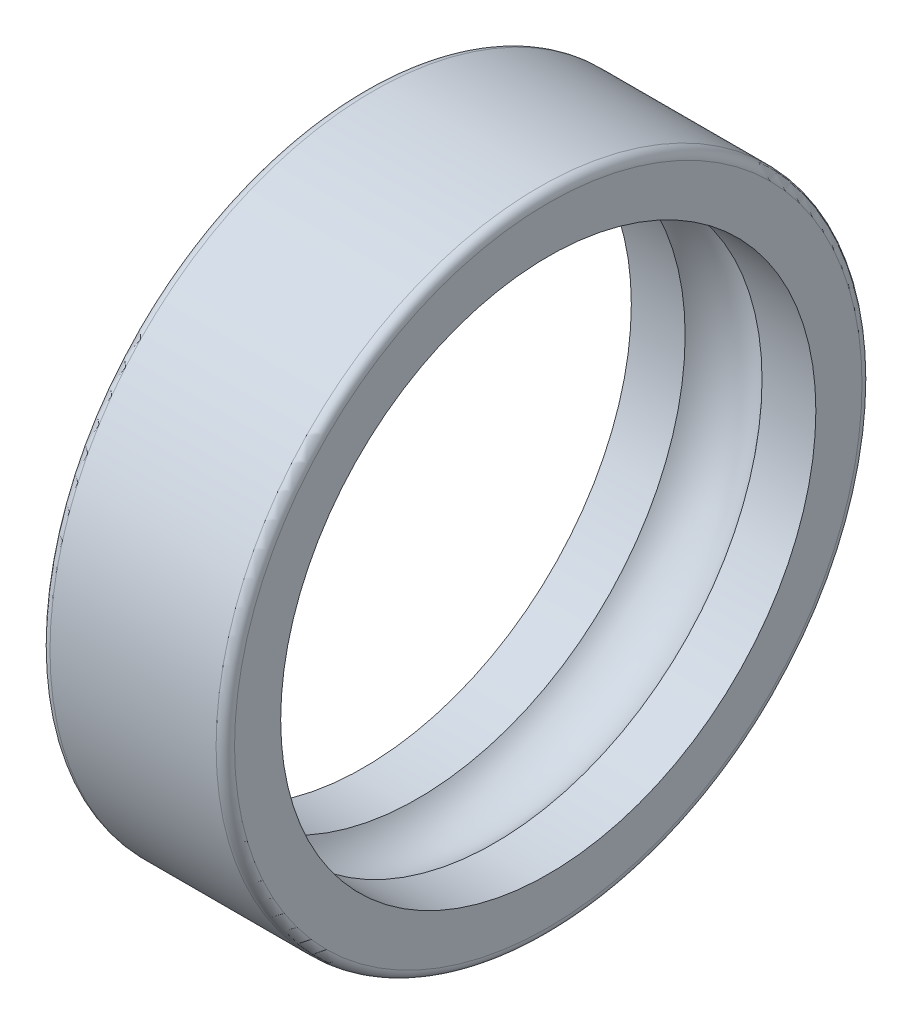
ISO-10303-21;
HEADER;
FILE_DESCRIPTION(('STEP AP214'),'2;1');
FILE_NAME('part.step','',(''),(''),'','','');
FILE_SCHEMA(('AUTOMOTIVE_DESIGN { 1 0 10303 214 1 1 1 1 }'));
ENDSEC;
DATA;
#1=APPLICATION_CONTEXT('core data for automotive mechanical design processes');
#2=APPLICATION_PROTOCOL_DEFINITION('international standard','automotive_design',2000,#1);
#3=PRODUCT_CONTEXT('',#1,'mechanical');
#4=PRODUCT('Part','Part','',(#3));
#5=PRODUCT_RELATED_PRODUCT_CATEGORY('part','',(#4));
#6=PRODUCT_DEFINITION_FORMATION('','',#4);
#7=PRODUCT_DEFINITION_CONTEXT('part definition',#1,'design');
#8=PRODUCT_DEFINITION('design','',#6,#7);
#9=PRODUCT_DEFINITION_SHAPE('','',#8);
#10=(LENGTH_UNIT() NAMED_UNIT(*) SI_UNIT(.MILLI.,.METRE.));
#11=(NAMED_UNIT(*) PLANE_ANGLE_UNIT() SI_UNIT($,.RADIAN.));
#12=(NAMED_UNIT(*) SI_UNIT($,.STERADIAN.) SOLID_ANGLE_UNIT());
#13=UNCERTAINTY_MEASURE_WITH_UNIT(LENGTH_MEASURE(1.E-05),#10,'distance_accuracy_value','');
#14=(GEOMETRIC_REPRESENTATION_CONTEXT(3) GLOBAL_UNCERTAINTY_ASSIGNED_CONTEXT((#13)) GLOBAL_UNIT_ASSIGNED_CONTEXT((#10,
#11,#12)) REPRESENTATION_CONTEXT('',''));
#15=CARTESIAN_POINT('',(0.,0.,0.));
#16=DIRECTION('',(0.,0.,1.));
#17=DIRECTION('',(1.,0.,0.));
#18=AXIS2_PLACEMENT_3D('',#15,#16,#17);
#19=CARTESIAN_POINT('',(0.,-12.,0.));
#20=DIRECTION('',(1.,0.,0.));
#21=DIRECTION('',(0.,0.,-1.));
#22=AXIS2_PLACEMENT_3D('',#19,#20,#21);
#23=TOROIDAL_SURFACE('',#22,15.4025015644562,3.2);
#24=CARTESIAN_POINT('',(-2.5,-12.,0.));
#25=DIRECTION('',(1.,0.,0.));
#26=DIRECTION('',(0.,0.,-1.));
#27=AXIS2_PLACEMENT_3D('',#24,#25,#26);
#28=CIRCLE('',#27,17.4);
#29=CARTESIAN_POINT('',(-2.5,-12.,-17.4));
#30=VERTEX_POINT('',#29);
#31=EDGE_CURVE('E79',#30,#30,#28,.T.);
#32=ORIENTED_EDGE('',*,*,#31,.F.);
#33=EDGE_LOOP('',(#32));
#34=FACE_BOUND('',#33,.T.);
#35=CARTESIAN_POINT('',(2.5,-12.,0.));
#36=DIRECTION('',(1.,0.,0.));
#37=DIRECTION('',(0.,0.,-1.));
#38=AXIS2_PLACEMENT_3D('',#35,#36,#37);
#39=CIRCLE('',#38,17.4);
#40=CARTESIAN_POINT('',(2.5,-12.,-17.4));
#41=VERTEX_POINT('',#40);
#42=EDGE_CURVE('E67',#41,#41,#39,.T.);
#43=ORIENTED_EDGE('',*,*,#42,.T.);
#44=EDGE_LOOP('',(#43));
#45=FACE_BOUND('',#44,.T.);
#46=ADVANCED_FACE('F43',(#34,#45),#23,.F.);
#47=CARTESIAN_POINT('',(6.,-12.,0.));
#48=DIRECTION('',(1.,0.,0.));
#49=DIRECTION('',(0.,0.,-1.));
#50=AXIS2_PLACEMENT_3D('',#47,#48,#49);
#51=CYLINDRICAL_SURFACE('',#50,17.4);
#52=CARTESIAN_POINT('',(6.,-12.,0.));
#53=DIRECTION('',(1.,0.,0.));
#54=DIRECTION('',(0.,0.,-1.));
#55=AXIS2_PLACEMENT_3D('',#52,#53,#54);
#56=CIRCLE('',#55,17.4);
#57=CARTESIAN_POINT('',(6.,-12.,-17.4));
#58=VERTEX_POINT('',#57);
#59=EDGE_CURVE('E71',#58,#58,#56,.T.);
#60=ORIENTED_EDGE('',*,*,#59,.T.);
#61=EDGE_LOOP('',(#60));
#62=FACE_BOUND('',#61,.T.);
#63=ORIENTED_EDGE('',*,*,#42,.F.);
#64=EDGE_LOOP('',(#63));
#65=FACE_BOUND('',#64,.T.);
#66=ADVANCED_FACE('F89',(#62,#65),#51,.F.);
#67=CARTESIAN_POINT('',(6.,0.,0.));
#68=DIRECTION('',(1.,0.,0.));
#69=DIRECTION('',(0.,0.,-1.));
#70=AXIS2_PLACEMENT_3D('',#67,#68,#69);
#71=PLANE('',#70);
#72=CARTESIAN_POINT('',(6.,-12.,0.));
#73=DIRECTION('',(1.,0.,0.));
#74=DIRECTION('',(0.,0.,-1.));
#75=AXIS2_PLACEMENT_3D('',#72,#73,#74);
#76=CIRCLE('',#75,20.4);
#77=CARTESIAN_POINT('',(6.,-12.,-20.4));
#78=VERTEX_POINT('',#77);
#79=EDGE_CURVE('E10',#78,#78,#76,.T.);
#80=ORIENTED_EDGE('',*,*,#79,.T.);
#81=EDGE_LOOP('',(#80));
#82=FACE_BOUND('',#81,.T.);
#83=ORIENTED_EDGE('',*,*,#59,.F.);
#84=EDGE_LOOP('',(#83));
#85=FACE_BOUND('',#84,.T.);
#86=ADVANCED_FACE('F94',(#82,#85),#71,.T.);
#87=CARTESIAN_POINT('',(6.,-12.,0.));
#88=DIRECTION('',(1.,0.,0.));
#89=DIRECTION('',(0.,0.,-1.));
#90=AXIS2_PLACEMENT_3D('',#87,#88,#89);
#91=CYLINDRICAL_SURFACE('',#90,21.);
#92=CARTESIAN_POINT('',(-5.4,-12.,0.));
#93=DIRECTION('',(1.,0.,0.));
#94=DIRECTION('',(0.,0.,-1.));
#95=AXIS2_PLACEMENT_3D('',#92,#93,#94);
#96=CIRCLE('',#95,21.);
#97=CARTESIAN_POINT('',(-5.4,-12.,-21.));
#98=VERTEX_POINT('',#97);
#99=EDGE_CURVE('E56',#98,#98,#96,.T.);
#100=ORIENTED_EDGE('',*,*,#99,.T.);
#101=EDGE_LOOP('',(#100));
#102=FACE_BOUND('',#101,.T.);
#103=CARTESIAN_POINT('',(5.4,-12.,0.));
#104=DIRECTION('',(1.,0.,0.));
#105=DIRECTION('',(0.,0.,-1.));
#106=AXIS2_PLACEMENT_3D('',#103,#104,#105);
#107=CIRCLE('',#106,21.);
#108=CARTESIAN_POINT('',(5.4,-12.,-21.));
#109=VERTEX_POINT('',#108);
#110=EDGE_CURVE('E61',#109,#109,#107,.F.);
#111=ORIENTED_EDGE('',*,*,#110,.T.);
#112=EDGE_LOOP('',(#111));
#113=FACE_BOUND('',#112,.T.);
#114=ADVANCED_FACE('F100',(#102,#113),#91,.T.);
#115=CARTESIAN_POINT('',(-6.,0.,0.));
#116=DIRECTION('',(1.,0.,0.));
#117=DIRECTION('',(0.,0.,-1.));
#118=AXIS2_PLACEMENT_3D('',#115,#116,#117);
#119=PLANE('',#118);
#120=CARTESIAN_POINT('',(-6.,-12.,0.));
#121=DIRECTION('',(1.,0.,0.));
#122=DIRECTION('',(0.,0.,-1.));
#123=AXIS2_PLACEMENT_3D('',#120,#121,#122);
#124=CIRCLE('',#123,20.4);
#125=CARTESIAN_POINT('',(-6.,-12.,-20.4));
#126=VERTEX_POINT('',#125);
#127=EDGE_CURVE('E51',#126,#126,#124,.F.);
#128=ORIENTED_EDGE('',*,*,#127,.T.);
#129=EDGE_LOOP('',(#128));
#130=FACE_BOUND('',#129,.T.);
#131=CARTESIAN_POINT('',(-6.,-12.,0.));
#132=DIRECTION('',(1.,0.,0.));
#133=DIRECTION('',(0.,0.,-1.));
#134=AXIS2_PLACEMENT_3D('',#131,#132,#133);
#135=CIRCLE('',#134,17.4);
#136=CARTESIAN_POINT('',(-6.,-12.,-17.4));
#137=VERTEX_POINT('',#136);
#138=EDGE_CURVE('E75',#137,#137,#135,.T.);
#139=ORIENTED_EDGE('',*,*,#138,.T.);
#140=EDGE_LOOP('',(#139));
#141=FACE_BOUND('',#140,.T.);
#142=ADVANCED_FACE('F111',(#130,#141),#119,.F.);
#143=CARTESIAN_POINT('',(6.,-12.,0.));
#144=DIRECTION('',(1.,0.,0.));
#145=DIRECTION('',(0.,0.,-1.));
#146=AXIS2_PLACEMENT_3D('',#143,#144,#145);
#147=CYLINDRICAL_SURFACE('',#146,17.4);
#148=ORIENTED_EDGE('',*,*,#31,.T.);
#149=EDGE_LOOP('',(#148));
#150=FACE_BOUND('',#149,.T.);
#151=ORIENTED_EDGE('',*,*,#138,.F.);
#152=EDGE_LOOP('',(#151));
#153=FACE_BOUND('',#152,.T.);
#154=ADVANCED_FACE('F84',(#150,#153),#147,.F.);
#155=CARTESIAN_POINT('',(-5.4,-12.,0.));
#156=DIRECTION('',(1.,0.,0.));
#157=DIRECTION('',(0.,0.,-1.));
#158=AXIS2_PLACEMENT_3D('',#155,#156,#157);
#159=TOROIDAL_SURFACE('',#158,20.4,0.6);
#160=ORIENTED_EDGE('',*,*,#127,.F.);
#161=EDGE_LOOP('',(#160));
#162=FACE_BOUND('',#161,.T.);
#163=ORIENTED_EDGE('',*,*,#99,.F.);
#164=EDGE_LOOP('',(#163));
#165=FACE_BOUND('',#164,.T.);
#166=ADVANCED_FACE('F103',(#162,#165),#159,.T.);
#167=CARTESIAN_POINT('',(5.4,-12.,0.));
#168=DIRECTION('',(1.,0.,0.));
#169=DIRECTION('',(0.,0.,-1.));
#170=AXIS2_PLACEMENT_3D('',#167,#168,#169);
#171=TOROIDAL_SURFACE('',#170,20.4,0.6);
#172=ORIENTED_EDGE('',*,*,#110,.F.);
#173=EDGE_LOOP('',(#172));
#174=FACE_BOUND('',#173,.T.);
#175=ORIENTED_EDGE('',*,*,#79,.F.);
#176=EDGE_LOOP('',(#175));
#177=FACE_BOUND('',#176,.T.);
#178=ADVANCED_FACE('F45',(#174,#177),#171,.T.);
#179=CLOSED_SHELL('',(#46,#66,#86,#114,#142,#154,#166,#178));
#180=MANIFOLD_SOLID_BREP('B2',#179);
#181=ADVANCED_BREP_SHAPE_REPRESENTATION('',(#18,#180),#14);
#182=SHAPE_DEFINITION_REPRESENTATION(#9,#181);
ENDSEC;
END-ISO-10303-21;
